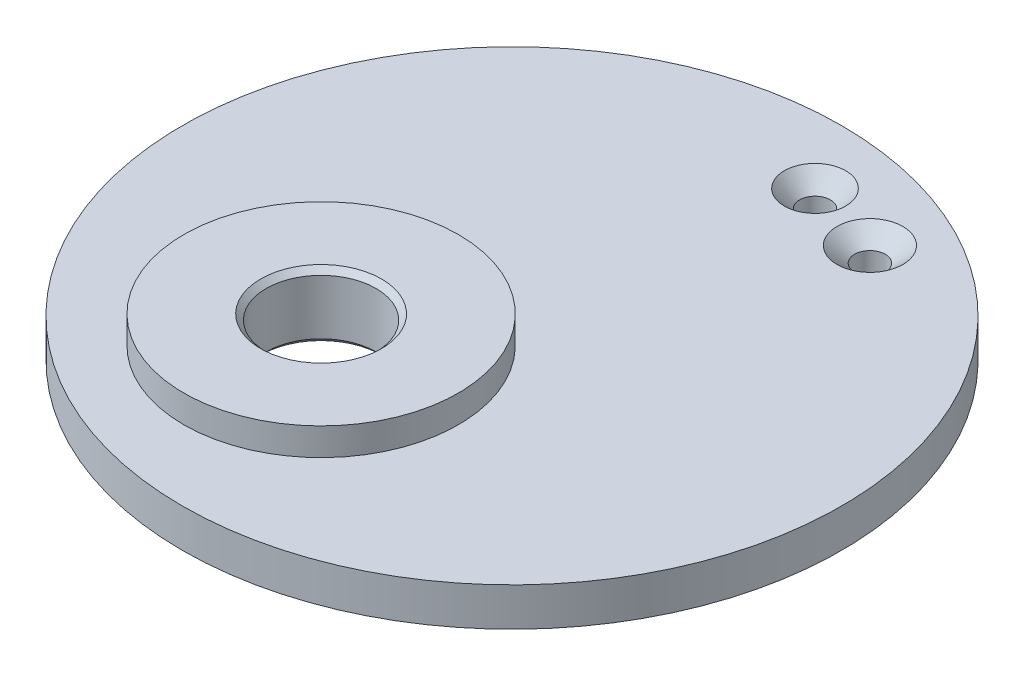
ISO-10303-21;
HEADER;
FILE_DESCRIPTION(('STEP AP214'),'2;1');
FILE_NAME('part.step','',(''),(''),'','','');
FILE_SCHEMA(('AUTOMOTIVE_DESIGN { 1 0 10303 214 1 1 1 1 }'));
ENDSEC;
DATA;
#1=APPLICATION_CONTEXT('core data for automotive mechanical design processes');
#2=APPLICATION_PROTOCOL_DEFINITION('international standard','automotive_design',2000,#1);
#3=PRODUCT_CONTEXT('',#1,'mechanical');
#4=PRODUCT('Part','Part','',(#3));
#5=PRODUCT_RELATED_PRODUCT_CATEGORY('part','',(#4));
#6=PRODUCT_DEFINITION_FORMATION('','',#4);
#7=PRODUCT_DEFINITION_CONTEXT('part definition',#1,'design');
#8=PRODUCT_DEFINITION('design','',#6,#7);
#9=PRODUCT_DEFINITION_SHAPE('','',#8);
#10=(LENGTH_UNIT() NAMED_UNIT(*) SI_UNIT(.MILLI.,.METRE.));
#11=(NAMED_UNIT(*) PLANE_ANGLE_UNIT() SI_UNIT($,.RADIAN.));
#12=(NAMED_UNIT(*) SI_UNIT($,.STERADIAN.) SOLID_ANGLE_UNIT());
#13=UNCERTAINTY_MEASURE_WITH_UNIT(LENGTH_MEASURE(1.E-05),#10,'distance_accuracy_value','');
#14=(GEOMETRIC_REPRESENTATION_CONTEXT(3) GLOBAL_UNCERTAINTY_ASSIGNED_CONTEXT((#13)) GLOBAL_UNIT_ASSIGNED_CONTEXT((#10,
#11,#12)) REPRESENTATION_CONTEXT('',''));
#15=CARTESIAN_POINT('',(0.,0.,0.));
#16=DIRECTION('',(0.,0.,1.));
#17=DIRECTION('',(1.,0.,0.));
#18=AXIS2_PLACEMENT_3D('',#15,#16,#17);
#19=CARTESIAN_POINT('',(0.,4.445,0.));
#20=DIRECTION('',(0.,-1.,0.));
#21=DIRECTION('',(0.,0.,-1.));
#22=AXIS2_PLACEMENT_3D('',#19,#20,#21);
#23=CYLINDRICAL_SURFACE('',#22,38.1);
#24=CARTESIAN_POINT('',(0.,4.445,0.));
#25=DIRECTION('',(0.,1.,0.));
#26=DIRECTION('',(0.,0.,1.));
#27=AXIS2_PLACEMENT_3D('',#24,#25,#26);
#28=CIRCLE('',#27,38.1);
#29=CARTESIAN_POINT('',(0.,4.445,38.1));
#30=VERTEX_POINT('',#29);
#31=EDGE_CURVE('E66',#30,#30,#28,.T.);
#32=ORIENTED_EDGE('',*,*,#31,.F.);
#33=EDGE_LOOP('',(#32));
#34=FACE_BOUND('',#33,.T.);
#35=CARTESIAN_POINT('',(0.,0.,0.));
#36=DIRECTION('',(0.,1.,0.));
#37=DIRECTION('',(0.,0.,1.));
#38=AXIS2_PLACEMENT_3D('',#35,#36,#37);
#39=CIRCLE('',#38,38.1);
#40=CARTESIAN_POINT('',(0.,0.,38.1));
#41=VERTEX_POINT('',#40);
#42=EDGE_CURVE('E67',#41,#41,#39,.T.);
#43=ORIENTED_EDGE('',*,*,#42,.T.);
#44=EDGE_LOOP('',(#43));
#45=FACE_BOUND('',#44,.T.);
#46=ADVANCED_FACE('F32',(#34,#45),#23,.T.);
#47=CARTESIAN_POINT('',(0.,4.445,0.));
#48=DIRECTION('',(0.,1.,0.));
#49=DIRECTION('',(0.,0.,1.));
#50=AXIS2_PLACEMENT_3D('',#47,#48,#49);
#51=PLANE('',#50);
#52=CARTESIAN_POINT('',(-8.06000000000004,4.445,14.01));
#53=DIRECTION('',(0.,1.,0.));
#54=DIRECTION('',(0.,0.,1.));
#55=AXIS2_PLACEMENT_3D('',#52,#53,#54);
#56=CIRCLE('',#55,15.875);
#57=CARTESIAN_POINT('',(-8.06000000000004,4.445,29.885));
#58=VERTEX_POINT('',#57);
#59=EDGE_CURVE('E53',#58,#58,#56,.T.);
#60=ORIENTED_EDGE('',*,*,#59,.F.);
#61=EDGE_LOOP('',(#60));
#62=FACE_BOUND('',#61,.T.);
#63=CARTESIAN_POINT('',(4.759999878,4.445,-30.270007278));
#64=DIRECTION('',(0.,1.,0.));
#65=DIRECTION('',(0.,0.,1.));
#66=AXIS2_PLACEMENT_3D('',#63,#64,#65);
#67=CIRCLE('',#66,3.54439065124256);
#68=CARTESIAN_POINT('',(4.759999878,4.445,-26.7256166267574));
#69=VERTEX_POINT('',#68);
#70=EDGE_CURVE('E57',#69,#69,#67,.F.);
#71=ORIENTED_EDGE('',*,*,#70,.T.);
#72=EDGE_LOOP('',(#71));
#73=FACE_BOUND('',#72,.T.);
#74=CARTESIAN_POINT('',(13.649999878,4.445,-27.730007278));
#75=DIRECTION('',(0.,1.,0.));
#76=DIRECTION('',(0.,0.,1.));
#77=AXIS2_PLACEMENT_3D('',#74,#75,#76);
#78=CIRCLE('',#77,3.81000000000001);
#79=CARTESIAN_POINT('',(13.649999878,4.445,-23.920007278));
#80=VERTEX_POINT('',#79);
#81=EDGE_CURVE('E60',#80,#80,#78,.F.);
#82=ORIENTED_EDGE('',*,*,#81,.T.);
#83=EDGE_LOOP('',(#82));
#84=FACE_BOUND('',#83,.T.);
#85=ORIENTED_EDGE('',*,*,#31,.T.);
#86=EDGE_LOOP('',(#85));
#87=FACE_BOUND('',#86,.T.);
#88=ADVANCED_FACE('F101',(#62,#73,#84,#87),#51,.T.);
#89=CARTESIAN_POINT('',(0.,0.,0.));
#90=DIRECTION('',(0.,1.,0.));
#91=DIRECTION('',(0.,0.,1.));
#92=AXIS2_PLACEMENT_3D('',#89,#90,#91);
#93=PLANE('',#92);
#94=CARTESIAN_POINT('',(-8.06000000000004,0.,14.01));
#95=DIRECTION('',(0.,1.,0.));
#96=DIRECTION('',(0.,0.,1.));
#97=AXIS2_PLACEMENT_3D('',#94,#95,#96);
#98=CIRCLE('',#97,6.98500000000005);
#99=CARTESIAN_POINT('',(-8.06000000000004,0.,20.9950000000001));
#100=VERTEX_POINT('',#99);
#101=EDGE_CURVE('E40',#100,#100,#98,.T.);
#102=ORIENTED_EDGE('',*,*,#101,.T.);
#103=EDGE_LOOP('',(#102));
#104=FACE_BOUND('',#103,.T.);
#105=CARTESIAN_POINT('',(4.759999878,0.,-30.270007278));
#106=DIRECTION('',(0.,1.,0.));
#107=DIRECTION('',(0.,0.,1.));
#108=AXIS2_PLACEMENT_3D('',#105,#106,#107);
#109=CIRCLE('',#108,1.778);
#110=CARTESIAN_POINT('',(4.759999878,0.,-28.492007278));
#111=VERTEX_POINT('',#110);
#112=EDGE_CURVE('E70',#111,#111,#109,.T.);
#113=ORIENTED_EDGE('',*,*,#112,.T.);
#114=EDGE_LOOP('',(#113));
#115=FACE_BOUND('',#114,.T.);
#116=CARTESIAN_POINT('',(13.649999878,0.,-27.730007278));
#117=DIRECTION('',(0.,1.,0.));
#118=DIRECTION('',(0.,0.,1.));
#119=AXIS2_PLACEMENT_3D('',#116,#117,#118);
#120=CIRCLE('',#119,1.778);
#121=CARTESIAN_POINT('',(13.649999878,0.,-25.952007278));
#122=VERTEX_POINT('',#121);
#123=EDGE_CURVE('E73',#122,#122,#120,.T.);
#124=ORIENTED_EDGE('',*,*,#123,.T.);
#125=EDGE_LOOP('',(#124));
#126=FACE_BOUND('',#125,.T.);
#127=ORIENTED_EDGE('',*,*,#42,.F.);
#128=EDGE_LOOP('',(#127));
#129=FACE_BOUND('',#128,.T.);
#130=ADVANCED_FACE('F107',(#104,#115,#126,#129),#93,.F.);
#131=CARTESIAN_POINT('',(13.649999878,0.,-27.730007278));
#132=DIRECTION('',(0.,1.,0.));
#133=DIRECTION('',(0.,0.,1.));
#134=AXIS2_PLACEMENT_3D('',#131,#132,#133);
#135=CYLINDRICAL_SURFACE('',#134,1.778);
#136=CARTESIAN_POINT('',(13.649999878,2.67860934875742,-27.730007278));
#137=DIRECTION('',(0.,1.,0.));
#138=DIRECTION('',(0.,0.,1.));
#139=AXIS2_PLACEMENT_3D('',#136,#137,#138);
#140=CIRCLE('',#139,1.778);
#141=CARTESIAN_POINT('',(13.649999878,2.67860934875742,-25.952007278));
#142=VERTEX_POINT('',#141);
#143=EDGE_CURVE('E54',#142,#142,#140,.T.);
#144=ORIENTED_EDGE('',*,*,#143,.T.);
#145=EDGE_LOOP('',(#144));
#146=FACE_BOUND('',#145,.T.);
#147=ORIENTED_EDGE('',*,*,#123,.F.);
#148=EDGE_LOOP('',(#147));
#149=FACE_BOUND('',#148,.T.);
#150=ADVANCED_FACE('F167',(#146,#149),#135,.F.);
#151=CARTESIAN_POINT('',(4.759999878,0.,-30.270007278));
#152=DIRECTION('',(0.,1.,0.));
#153=DIRECTION('',(0.,0.,1.));
#154=AXIS2_PLACEMENT_3D('',#151,#152,#153);
#155=CYLINDRICAL_SURFACE('',#154,1.778);
#156=CARTESIAN_POINT('',(4.759999878,2.413,-30.270007278));
#157=DIRECTION('',(0.,1.,0.));
#158=DIRECTION('',(0.,0.,1.));
#159=AXIS2_PLACEMENT_3D('',#156,#157,#158);
#160=CIRCLE('',#159,1.778);
#161=CARTESIAN_POINT('',(4.759999878,2.413,-28.492007278));
#162=VERTEX_POINT('',#161);
#163=EDGE_CURVE('E63',#162,#162,#160,.T.);
#164=ORIENTED_EDGE('',*,*,#163,.T.);
#165=EDGE_LOOP('',(#164));
#166=FACE_BOUND('',#165,.T.);
#167=ORIENTED_EDGE('',*,*,#112,.F.);
#168=EDGE_LOOP('',(#167));
#169=FACE_BOUND('',#168,.T.);
#170=ADVANCED_FACE('F121',(#166,#169),#155,.F.);
#171=CARTESIAN_POINT('',(4.759999878,2.413,-30.270007278));
#172=DIRECTION('',(0.,1.,0.));
#173=DIRECTION('',(0.,0.,1.));
#174=AXIS2_PLACEMENT_3D('',#171,#172,#173);
#175=CONICAL_SURFACE('',#174,1.778,0.715584993317672);
#176=ORIENTED_EDGE('',*,*,#70,.F.);
#177=EDGE_LOOP('',(#176));
#178=FACE_BOUND('',#177,.T.);
#179=ORIENTED_EDGE('',*,*,#163,.F.);
#180=EDGE_LOOP('',(#179));
#181=FACE_BOUND('',#180,.T.);
#182=ADVANCED_FACE('F115',(#178,#181),#175,.F.);
#183=CARTESIAN_POINT('',(13.649999878,2.67860934875742,-27.730007278));
#184=DIRECTION('',(0.,1.,0.));
#185=DIRECTION('',(0.,0.,1.));
#186=AXIS2_PLACEMENT_3D('',#183,#184,#185);
#187=CONICAL_SURFACE('',#186,1.778,0.855211333477223);
#188=ORIENTED_EDGE('',*,*,#81,.F.);
#189=EDGE_LOOP('',(#188));
#190=FACE_BOUND('',#189,.T.);
#191=ORIENTED_EDGE('',*,*,#143,.F.);
#192=EDGE_LOOP('',(#191));
#193=FACE_BOUND('',#192,.T.);
#194=ADVANCED_FACE('F97',(#190,#193),#187,.F.);
#195=CARTESIAN_POINT('',(-8.06000000000004,7.62,14.01));
#196=DIRECTION('',(0.,-1.,0.));
#197=DIRECTION('',(0.,0.,-1.));
#198=AXIS2_PLACEMENT_3D('',#195,#196,#197);
#199=CYLINDRICAL_SURFACE('',#198,15.875);
#200=ORIENTED_EDGE('',*,*,#59,.T.);
#201=EDGE_LOOP('',(#200));
#202=FACE_BOUND('',#201,.T.);
#203=CARTESIAN_POINT('',(-8.06000000000004,7.62,14.01));
#204=DIRECTION('',(0.,-1.,0.));
#205=DIRECTION('',(0.,0.,-1.));
#206=AXIS2_PLACEMENT_3D('',#203,#204,#205);
#207=CIRCLE('',#206,15.875);
#208=CARTESIAN_POINT('',(-8.06000000000004,7.62,-1.86499999999998));
#209=VERTEX_POINT('',#208);
#210=EDGE_CURVE('E76',#209,#209,#207,.T.);
#211=ORIENTED_EDGE('',*,*,#210,.T.);
#212=EDGE_LOOP('',(#211));
#213=FACE_BOUND('',#212,.T.);
#214=ADVANCED_FACE('F84',(#202,#213),#199,.T.);
#215=CARTESIAN_POINT('',(-8.06000000000004,7.62,14.01));
#216=DIRECTION('',(0.,-1.,0.));
#217=DIRECTION('',(0.,0.,-1.));
#218=AXIS2_PLACEMENT_3D('',#215,#216,#217);
#219=PLANE('',#218);
#220=CARTESIAN_POINT('',(-8.06000000000004,7.62,14.01));
#221=DIRECTION('',(0.,-1.,0.));
#222=DIRECTION('',(0.,0.,-1.));
#223=AXIS2_PLACEMENT_3D('',#220,#221,#222);
#224=CIRCLE('',#223,6.98499999999995);
#225=CARTESIAN_POINT('',(-8.06000000000004,7.62,7.02500000000007));
#226=VERTEX_POINT('',#225);
#227=EDGE_CURVE('E10',#226,#226,#224,.T.);
#228=ORIENTED_EDGE('',*,*,#227,.T.);
#229=EDGE_LOOP('',(#228));
#230=FACE_BOUND('',#229,.T.);
#231=ORIENTED_EDGE('',*,*,#210,.F.);
#232=EDGE_LOOP('',(#231));
#233=FACE_BOUND('',#232,.T.);
#234=ADVANCED_FACE('F86',(#230,#233),#219,.F.);
#235=CARTESIAN_POINT('',(-8.06000000000004,7.62,14.01));
#236=DIRECTION('',(0.,-1.,0.));
#237=DIRECTION('',(0.,0.,-1.));
#238=AXIS2_PLACEMENT_3D('',#235,#236,#237);
#239=CYLINDRICAL_SURFACE('',#238,6.35);
#240=CARTESIAN_POINT('',(-8.06000000000004,0.635000000000054,14.01));
#241=DIRECTION('',(0.,1.,0.));
#242=DIRECTION('',(0.,0.,1.));
#243=AXIS2_PLACEMENT_3D('',#240,#241,#242);
#244=CIRCLE('',#243,6.35);
#245=CARTESIAN_POINT('',(-8.06000000000004,0.635000000000054,20.36));
#246=VERTEX_POINT('',#245);
#247=EDGE_CURVE('E44',#246,#246,#244,.F.);
#248=ORIENTED_EDGE('',*,*,#247,.T.);
#249=EDGE_LOOP('',(#248));
#250=FACE_BOUND('',#249,.T.);
#251=CARTESIAN_POINT('',(-8.06000000000004,6.98500000000004,14.01));
#252=DIRECTION('',(0.,-1.,0.));
#253=DIRECTION('',(0.,0.,-1.));
#254=AXIS2_PLACEMENT_3D('',#251,#252,#253);
#255=CIRCLE('',#254,6.35);
#256=CARTESIAN_POINT('',(-8.06000000000004,6.98500000000004,7.66000000000002));
#257=VERTEX_POINT('',#256);
#258=EDGE_CURVE('E48',#257,#257,#255,.F.);
#259=ORIENTED_EDGE('',*,*,#258,.T.);
#260=EDGE_LOOP('',(#259));
#261=FACE_BOUND('',#260,.T.);
#262=ADVANCED_FACE('F88',(#250,#261),#239,.F.);
#263=CARTESIAN_POINT('',(-8.06000000000004,0.635000000000054,14.01));
#264=DIRECTION('',(0.,-1.,0.));
#265=DIRECTION('',(0.,0.,-1.));
#266=AXIS2_PLACEMENT_3D('',#263,#264,#265);
#267=CONICAL_SURFACE('',#266,6.35,0.785398163397443);
#268=ORIENTED_EDGE('',*,*,#101,.F.);
#269=EDGE_LOOP('',(#268));
#270=FACE_BOUND('',#269,.T.);
#271=ORIENTED_EDGE('',*,*,#247,.F.);
#272=EDGE_LOOP('',(#271));
#273=FACE_BOUND('',#272,.T.);
#274=ADVANCED_FACE('F94',(#270,#273),#267,.F.);
#275=CARTESIAN_POINT('',(-8.06000000000004,7.62,14.01));
#276=DIRECTION('',(0.,1.,0.));
#277=DIRECTION('',(0.,0.,1.));
#278=AXIS2_PLACEMENT_3D('',#275,#276,#277);
#279=CONICAL_SURFACE('',#278,6.98499999999995,0.785398163397444);
#280=ORIENTED_EDGE('',*,*,#258,.F.);
#281=EDGE_LOOP('',(#280));
#282=FACE_BOUND('',#281,.T.);
#283=ORIENTED_EDGE('',*,*,#227,.F.);
#284=EDGE_LOOP('',(#283));
#285=FACE_BOUND('',#284,.T.);
#286=ADVANCED_FACE('F35',(#282,#285),#279,.F.);
#287=CLOSED_SHELL('',(#46,#88,#130,#150,#170,#182,#194,#214,#234,#262,#274,#286));
#288=MANIFOLD_SOLID_BREP('B2',#287);
#289=ADVANCED_BREP_SHAPE_REPRESENTATION('',(#18,#288),#14);
#290=SHAPE_DEFINITION_REPRESENTATION(#9,#289);
ENDSEC;
END-ISO-10303-21;
